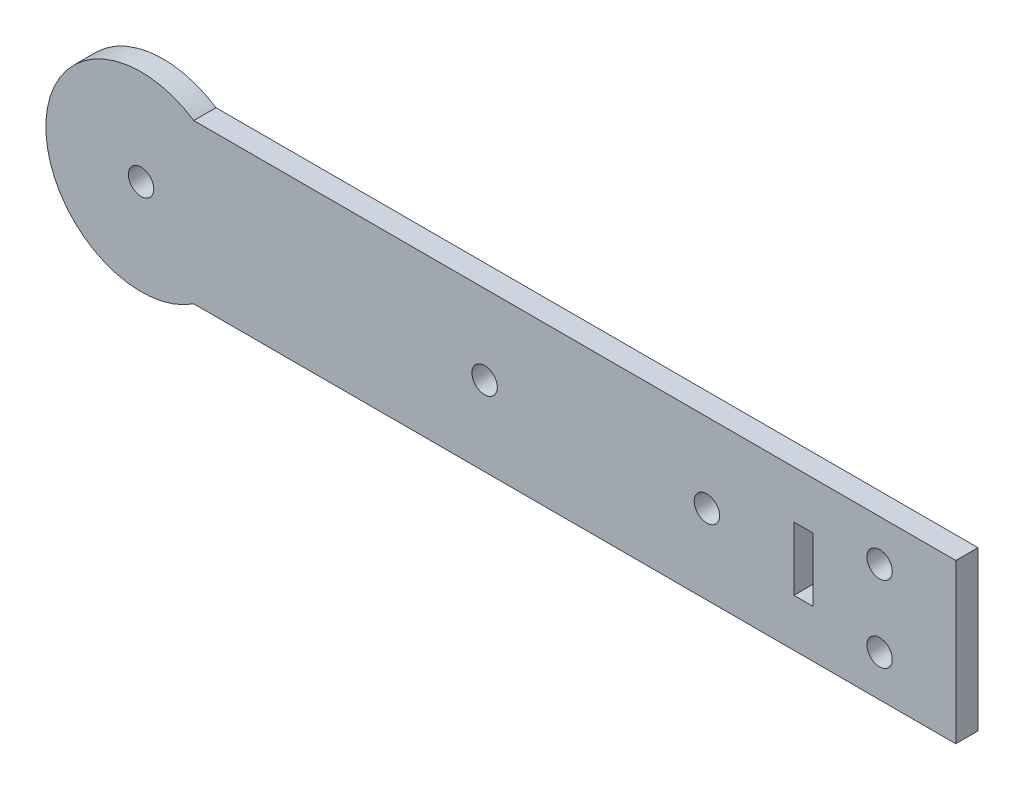
ISO-10303-21;
HEADER;
FILE_DESCRIPTION(('STEP AP214'),'2;1');
FILE_NAME('part.step','',(''),(''),'','','');
FILE_SCHEMA(('AUTOMOTIVE_DESIGN { 1 0 10303 214 1 1 1 1 }'));
ENDSEC;
DATA;
#1=APPLICATION_CONTEXT('core data for automotive mechanical design processes');
#2=APPLICATION_PROTOCOL_DEFINITION('international standard','automotive_design',2000,#1);
#3=PRODUCT_CONTEXT('',#1,'mechanical');
#4=PRODUCT('Part','Part','',(#3));
#5=PRODUCT_RELATED_PRODUCT_CATEGORY('part','',(#4));
#6=PRODUCT_DEFINITION_FORMATION('','',#4);
#7=PRODUCT_DEFINITION_CONTEXT('part definition',#1,'design');
#8=PRODUCT_DEFINITION('design','',#6,#7);
#9=PRODUCT_DEFINITION_SHAPE('','',#8);
#10=(LENGTH_UNIT() NAMED_UNIT(*) SI_UNIT(.MILLI.,.METRE.));
#11=(NAMED_UNIT(*) PLANE_ANGLE_UNIT() SI_UNIT($,.RADIAN.));
#12=(NAMED_UNIT(*) SI_UNIT($,.STERADIAN.) SOLID_ANGLE_UNIT());
#13=UNCERTAINTY_MEASURE_WITH_UNIT(LENGTH_MEASURE(1.E-05),#10,'distance_accuracy_value','');
#14=(GEOMETRIC_REPRESENTATION_CONTEXT(3) GLOBAL_UNCERTAINTY_ASSIGNED_CONTEXT((#13)) GLOBAL_UNIT_ASSIGNED_CONTEXT((#10,
#11,#12)) REPRESENTATION_CONTEXT('',''));
#15=CARTESIAN_POINT('',(0.,0.,0.));
#16=DIRECTION('',(0.,0.,1.));
#17=DIRECTION('',(1.,0.,0.));
#18=AXIS2_PLACEMENT_3D('',#15,#16,#17);
#19=CARTESIAN_POINT('',(-93.389372273481,0.,3.5));
#20=DIRECTION('',(0.,0.,1.));
#21=DIRECTION('',(1.,0.,0.));
#22=AXIS2_PLACEMENT_3D('',#19,#20,#21);
#23=PLANE('',#22);
#24=CARTESIAN_POINT('',(-39.2915619758885,0.,3.5));
#25=DIRECTION('',(0.,0.,1.));
#26=DIRECTION('',(1.,0.,0.));
#27=AXIS2_PLACEMENT_3D('',#24,#25,#26);
#28=CIRCLE('',#27,2.);
#29=CARTESIAN_POINT('',(-37.2915619758885,0.,3.5));
#30=VERTEX_POINT('',#29);
#31=EDGE_CURVE('E279',#30,#30,#28,.T.);
#32=ORIENTED_EDGE('',*,*,#31,.F.);
#33=EDGE_LOOP('',(#32));
#34=FACE_BOUND('',#33,.T.);
#35=DIRECTION('',(-1.,0.,0.));
#36=VECTOR('',#35,1.);
#37=CARTESIAN_POINT('',(9.4021897024075,5.,3.5));
#38=LINE('',#37,#36);
#39=CARTESIAN_POINT('',(12.4021897024075,5.,3.5));
#40=VERTEX_POINT('',#39);
#41=CARTESIAN_POINT('',(9.4021897024075,5.,3.5));
#42=VERTEX_POINT('',#41);
#43=EDGE_CURVE('E117',#40,#42,#38,.T.);
#44=ORIENTED_EDGE('',*,*,#43,.F.);
#45=DIRECTION('',(0.,1.,0.));
#46=VECTOR('',#45,1.);
#47=CARTESIAN_POINT('',(12.4021897024075,5.,3.5));
#48=LINE('',#47,#46);
#49=CARTESIAN_POINT('',(12.4021897024075,-5.,3.5));
#50=VERTEX_POINT('',#49);
#51=EDGE_CURVE('E108',#50,#40,#48,.T.);
#52=ORIENTED_EDGE('',*,*,#51,.F.);
#53=DIRECTION('',(1.,0.,0.));
#54=VECTOR('',#53,1.);
#55=CARTESIAN_POINT('',(9.4021897024075,-5.,3.5));
#56=LINE('',#55,#54);
#57=CARTESIAN_POINT('',(9.4021897024075,-5.,3.5));
#58=VERTEX_POINT('',#57);
#59=EDGE_CURVE('E135',#58,#50,#56,.T.);
#60=ORIENTED_EDGE('',*,*,#59,.F.);
#61=DIRECTION('',(0.,-1.,0.));
#62=VECTOR('',#61,1.);
#63=CARTESIAN_POINT('',(9.4021897024075,5.,3.5));
#64=LINE('',#63,#62);
#65=EDGE_CURVE('E131',#42,#58,#64,.T.);
#66=ORIENTED_EDGE('',*,*,#65,.F.);
#67=EDGE_LOOP('',(#44,#52,#60,#66));
#68=FACE_BOUND('',#67,.T.);
#69=CARTESIAN_POINT('',(-93.389372273481,0.,3.5));
#70=DIRECTION('',(0.,0.,1.));
#71=DIRECTION('',(1.,0.,0.));
#72=AXIS2_PLACEMENT_3D('',#69,#70,#71);
#73=CIRCLE('',#72,2.);
#74=CARTESIAN_POINT('',(-91.389372273481,0.,3.5));
#75=VERTEX_POINT('',#74);
#76=EDGE_CURVE('E159',#75,#75,#73,.T.);
#77=ORIENTED_EDGE('',*,*,#76,.F.);
#78=EDGE_LOOP('',(#77));
#79=FACE_BOUND('',#78,.T.);
#80=CARTESIAN_POINT('',(-93.389372273481,0.,3.5));
#81=DIRECTION('',(0.,0.,1.));
#82=DIRECTION('',(1.,0.,0.));
#83=AXIS2_PLACEMENT_3D('',#80,#81,#82);
#84=CIRCLE('',#83,15.);
#85=CARTESIAN_POINT('',(-85.0978102975925,12.5,3.5));
#86=VERTEX_POINT('',#85);
#87=CARTESIAN_POINT('',(-85.0978102975925,-12.5,3.5));
#88=VERTEX_POINT('',#87);
#89=EDGE_CURVE('E175',#86,#88,#84,.T.);
#90=ORIENTED_EDGE('',*,*,#89,.T.);
#91=DIRECTION('',(1.,0.,0.));
#92=VECTOR('',#91,1.);
#93=CARTESIAN_POINT('',(-85.0978102975925,-12.5,3.5));
#94=LINE('',#93,#92);
#95=CARTESIAN_POINT('',(34.9021897024075,-12.5,3.5));
#96=VERTEX_POINT('',#95);
#97=EDGE_CURVE('E179',#88,#96,#94,.T.);
#98=ORIENTED_EDGE('',*,*,#97,.T.);
#99=DIRECTION('',(0.,1.,0.));
#100=VECTOR('',#99,1.);
#101=CARTESIAN_POINT('',(34.9021897024075,12.5,3.5));
#102=LINE('',#101,#100);
#103=CARTESIAN_POINT('',(34.9021897024075,12.5,3.5));
#104=VERTEX_POINT('',#103);
#105=EDGE_CURVE('E183',#96,#104,#102,.T.);
#106=ORIENTED_EDGE('',*,*,#105,.T.);
#107=DIRECTION('',(-1.,0.,0.));
#108=VECTOR('',#107,1.);
#109=CARTESIAN_POINT('',(-85.0978102975925,12.5,3.5));
#110=LINE('',#109,#108);
#111=EDGE_CURVE('E186',#104,#86,#110,.T.);
#112=ORIENTED_EDGE('',*,*,#111,.T.);
#113=EDGE_LOOP('',(#90,#98,#106,#112));
#114=FACE_BOUND('',#113,.T.);
#115=CARTESIAN_POINT('',(22.9021897024075,6.,3.5));
#116=DIRECTION('',(0.,0.,1.));
#117=DIRECTION('',(1.,0.,0.));
#118=AXIS2_PLACEMENT_3D('',#115,#116,#117);
#119=CIRCLE('',#118,2.);
#120=CARTESIAN_POINT('',(24.9021897024075,6.,3.5));
#121=VERTEX_POINT('',#120);
#122=EDGE_CURVE('E167',#121,#121,#119,.T.);
#123=ORIENTED_EDGE('',*,*,#122,.F.);
#124=EDGE_LOOP('',(#123));
#125=FACE_BOUND('',#124,.T.);
#126=CARTESIAN_POINT('',(22.9021897024075,-6.,3.5));
#127=DIRECTION('',(0.,0.,1.));
#128=DIRECTION('',(-1.,0.,0.));
#129=AXIS2_PLACEMENT_3D('',#126,#127,#128);
#130=CIRCLE('',#129,2.);
#131=CARTESIAN_POINT('',(20.9021897024075,-6.,3.5));
#132=VERTEX_POINT('',#131);
#133=EDGE_CURVE('E143',#132,#132,#130,.T.);
#134=ORIENTED_EDGE('',*,*,#133,.F.);
#135=EDGE_LOOP('',(#134));
#136=FACE_BOUND('',#135,.T.);
#137=CARTESIAN_POINT('',(-4.29156197588848,0.,3.5));
#138=DIRECTION('',(0.,0.,1.));
#139=DIRECTION('',(1.,0.,0.));
#140=AXIS2_PLACEMENT_3D('',#137,#138,#139);
#141=CIRCLE('',#140,2.);
#142=CARTESIAN_POINT('',(-2.29156197588848,0.,3.5));
#143=VERTEX_POINT('',#142);
#144=EDGE_CURVE('E270',#143,#143,#141,.T.);
#145=ORIENTED_EDGE('',*,*,#144,.F.);
#146=EDGE_LOOP('',(#145));
#147=FACE_BOUND('',#146,.T.);
#148=ADVANCED_FACE('F42',(#34,#68,#79,#114,#125,#136,#147),#23,.T.);
#149=CARTESIAN_POINT('',(-93.389372273481,0.,0.));
#150=DIRECTION('',(0.,0.,1.));
#151=DIRECTION('',(1.,0.,0.));
#152=AXIS2_PLACEMENT_3D('',#149,#150,#151);
#153=PLANE('',#152);
#154=CARTESIAN_POINT('',(-93.389372273481,0.,0.));
#155=DIRECTION('',(0.,0.,1.));
#156=DIRECTION('',(1.,0.,0.));
#157=AXIS2_PLACEMENT_3D('',#154,#155,#156);
#158=CIRCLE('',#157,2.);
#159=CARTESIAN_POINT('',(-91.389372273481,0.,0.));
#160=VERTEX_POINT('',#159);
#161=EDGE_CURVE('E126',#160,#160,#158,.T.);
#162=ORIENTED_EDGE('',*,*,#161,.T.);
#163=EDGE_LOOP('',(#162));
#164=FACE_BOUND('',#163,.T.);
#165=CARTESIAN_POINT('',(22.9021897024075,6.,0.));
#166=DIRECTION('',(0.,0.,1.));
#167=DIRECTION('',(1.,0.,0.));
#168=AXIS2_PLACEMENT_3D('',#165,#166,#167);
#169=CIRCLE('',#168,2.);
#170=CARTESIAN_POINT('',(24.9021897024075,6.,0.));
#171=VERTEX_POINT('',#170);
#172=EDGE_CURVE('E163',#171,#171,#169,.T.);
#173=ORIENTED_EDGE('',*,*,#172,.T.);
#174=EDGE_LOOP('',(#173));
#175=FACE_BOUND('',#174,.T.);
#176=CARTESIAN_POINT('',(-93.389372273481,0.,0.));
#177=DIRECTION('',(0.,0.,1.));
#178=DIRECTION('',(1.,0.,0.));
#179=AXIS2_PLACEMENT_3D('',#176,#177,#178);
#180=CIRCLE('',#179,15.);
#181=CARTESIAN_POINT('',(-85.0978102975925,12.5,0.));
#182=VERTEX_POINT('',#181);
#183=CARTESIAN_POINT('',(-85.0978102975925,-12.5,0.));
#184=VERTEX_POINT('',#183);
#185=EDGE_CURVE('E171',#182,#184,#180,.T.);
#186=ORIENTED_EDGE('',*,*,#185,.F.);
#187=DIRECTION('',(-1.,0.,0.));
#188=VECTOR('',#187,1.);
#189=CARTESIAN_POINT('',(-85.0978102975925,12.5,0.));
#190=LINE('',#189,#188);
#191=CARTESIAN_POINT('',(34.9021897024075,12.5,0.));
#192=VERTEX_POINT('',#191);
#193=EDGE_CURVE('E180',#192,#182,#190,.T.);
#194=ORIENTED_EDGE('',*,*,#193,.F.);
#195=DIRECTION('',(0.,1.,0.));
#196=VECTOR('',#195,1.);
#197=CARTESIAN_POINT('',(34.9021897024075,12.5,0.));
#198=LINE('',#197,#196);
#199=CARTESIAN_POINT('',(34.9021897024075,-12.5,0.));
#200=VERTEX_POINT('',#199);
#201=EDGE_CURVE('E196',#200,#192,#198,.T.);
#202=ORIENTED_EDGE('',*,*,#201,.F.);
#203=DIRECTION('',(1.,0.,0.));
#204=VECTOR('',#203,1.);
#205=CARTESIAN_POINT('',(-85.0978102975925,-12.5,0.));
#206=LINE('',#205,#204);
#207=EDGE_CURVE('E193',#184,#200,#206,.T.);
#208=ORIENTED_EDGE('',*,*,#207,.F.);
#209=EDGE_LOOP('',(#186,#194,#202,#208));
#210=FACE_BOUND('',#209,.T.);
#211=DIRECTION('',(0.,1.,0.));
#212=VECTOR('',#211,1.);
#213=CARTESIAN_POINT('',(12.4021897024075,5.,0.));
#214=LINE('',#213,#212);
#215=CARTESIAN_POINT('',(12.4021897024075,-5.,0.));
#216=VERTEX_POINT('',#215);
#217=CARTESIAN_POINT('',(12.4021897024075,5.,0.));
#218=VERTEX_POINT('',#217);
#219=EDGE_CURVE('E66',#216,#218,#214,.T.);
#220=ORIENTED_EDGE('',*,*,#219,.T.);
#221=DIRECTION('',(-1.,0.,0.));
#222=VECTOR('',#221,1.);
#223=CARTESIAN_POINT('',(9.4021897024075,5.,0.));
#224=LINE('',#223,#222);
#225=CARTESIAN_POINT('',(9.4021897024075,5.,0.));
#226=VERTEX_POINT('',#225);
#227=EDGE_CURVE('E124',#218,#226,#224,.T.);
#228=ORIENTED_EDGE('',*,*,#227,.T.);
#229=DIRECTION('',(0.,-1.,0.));
#230=VECTOR('',#229,1.);
#231=CARTESIAN_POINT('',(9.4021897024075,5.,0.));
#232=LINE('',#231,#230);
#233=CARTESIAN_POINT('',(9.4021897024075,-5.,0.));
#234=VERTEX_POINT('',#233);
#235=EDGE_CURVE('E146',#226,#234,#232,.T.);
#236=ORIENTED_EDGE('',*,*,#235,.T.);
#237=DIRECTION('',(1.,0.,0.));
#238=VECTOR('',#237,1.);
#239=CARTESIAN_POINT('',(9.4021897024075,-5.,0.));
#240=LINE('',#239,#238);
#241=EDGE_CURVE('E118',#234,#216,#240,.T.);
#242=ORIENTED_EDGE('',*,*,#241,.T.);
#243=EDGE_LOOP('',(#220,#228,#236,#242));
#244=FACE_BOUND('',#243,.T.);
#245=CARTESIAN_POINT('',(22.9021897024075,-6.,0.));
#246=DIRECTION('',(0.,0.,1.));
#247=DIRECTION('',(-1.,0.,0.));
#248=AXIS2_PLACEMENT_3D('',#245,#246,#247);
#249=CIRCLE('',#248,2.);
#250=CARTESIAN_POINT('',(20.9021897024075,-6.,0.));
#251=VERTEX_POINT('',#250);
#252=EDGE_CURVE('E286',#251,#251,#249,.T.);
#253=ORIENTED_EDGE('',*,*,#252,.T.);
#254=EDGE_LOOP('',(#253));
#255=FACE_BOUND('',#254,.T.);
#256=CARTESIAN_POINT('',(-39.2915619758885,0.,0.));
#257=DIRECTION('',(0.,0.,1.));
#258=DIRECTION('',(1.,0.,0.));
#259=AXIS2_PLACEMENT_3D('',#256,#257,#258);
#260=CIRCLE('',#259,2.);
#261=CARTESIAN_POINT('',(-37.2915619758885,0.,0.));
#262=VERTEX_POINT('',#261);
#263=EDGE_CURVE('E273',#262,#262,#260,.T.);
#264=ORIENTED_EDGE('',*,*,#263,.T.);
#265=EDGE_LOOP('',(#264));
#266=FACE_BOUND('',#265,.T.);
#267=CARTESIAN_POINT('',(-4.29156197588848,0.,0.));
#268=DIRECTION('',(0.,0.,1.));
#269=DIRECTION('',(1.,0.,0.));
#270=AXIS2_PLACEMENT_3D('',#267,#268,#269);
#271=CIRCLE('',#270,2.);
#272=CARTESIAN_POINT('',(-2.29156197588848,0.,0.));
#273=VERTEX_POINT('',#272);
#274=EDGE_CURVE('E274',#273,#273,#271,.T.);
#275=ORIENTED_EDGE('',*,*,#274,.T.);
#276=EDGE_LOOP('',(#275));
#277=FACE_BOUND('',#276,.T.);
#278=ADVANCED_FACE('F219',(#164,#175,#210,#244,#255,#266,#277),#153,.F.);
#279=CARTESIAN_POINT('',(-93.389372273481,0.,3.5));
#280=DIRECTION('',(0.,0.,-1.));
#281=DIRECTION('',(-1.,0.,0.));
#282=AXIS2_PLACEMENT_3D('',#279,#280,#281);
#283=CYLINDRICAL_SURFACE('',#282,15.);
#284=ORIENTED_EDGE('',*,*,#185,.T.);
#285=DIRECTION('',(0.,0.,-1.));
#286=VECTOR('',#285,1.);
#287=CARTESIAN_POINT('',(-85.0978102975925,-12.5,3.5));
#288=LINE('',#287,#286);
#289=EDGE_CURVE('E11',#88,#184,#288,.T.);
#290=ORIENTED_EDGE('',*,*,#289,.F.);
#291=ORIENTED_EDGE('',*,*,#89,.F.);
#292=DIRECTION('',(0.,0.,-1.));
#293=VECTOR('',#292,1.);
#294=CARTESIAN_POINT('',(-85.0978102975925,12.5,3.5));
#295=LINE('',#294,#293);
#296=EDGE_CURVE('E189',#86,#182,#295,.T.);
#297=ORIENTED_EDGE('',*,*,#296,.T.);
#298=EDGE_LOOP('',(#284,#290,#291,#297));
#299=FACE_BOUND('',#298,.T.);
#300=ADVANCED_FACE('F44',(#299),#283,.T.);
#301=CARTESIAN_POINT('',(-85.0978102975925,-12.5,3.5));
#302=DIRECTION('',(0.,1.,0.));
#303=DIRECTION('',(0.,0.,1.));
#304=AXIS2_PLACEMENT_3D('',#301,#302,#303);
#305=PLANE('',#304);
#306=ORIENTED_EDGE('',*,*,#207,.T.);
#307=DIRECTION('',(0.,0.,-1.));
#308=VECTOR('',#307,1.);
#309=CARTESIAN_POINT('',(34.9021897024075,-12.5,3.5));
#310=LINE('',#309,#308);
#311=EDGE_CURVE('E51',#96,#200,#310,.T.);
#312=ORIENTED_EDGE('',*,*,#311,.F.);
#313=ORIENTED_EDGE('',*,*,#97,.F.);
#314=ORIENTED_EDGE('',*,*,#289,.T.);
#315=EDGE_LOOP('',(#306,#312,#313,#314));
#316=FACE_BOUND('',#315,.T.);
#317=ADVANCED_FACE('F230',(#316),#305,.F.);
#318=CARTESIAN_POINT('',(34.9021897024075,12.5,3.5));
#319=DIRECTION('',(-1.,0.,0.));
#320=DIRECTION('',(0.,0.,1.));
#321=AXIS2_PLACEMENT_3D('',#318,#319,#320);
#322=PLANE('',#321);
#323=ORIENTED_EDGE('',*,*,#201,.T.);
#324=DIRECTION('',(0.,0.,-1.));
#325=VECTOR('',#324,1.);
#326=CARTESIAN_POINT('',(34.9021897024075,12.5,3.5));
#327=LINE('',#326,#325);
#328=EDGE_CURVE('E204',#104,#192,#327,.T.);
#329=ORIENTED_EDGE('',*,*,#328,.F.);
#330=ORIENTED_EDGE('',*,*,#105,.F.);
#331=ORIENTED_EDGE('',*,*,#311,.T.);
#332=EDGE_LOOP('',(#323,#329,#330,#331));
#333=FACE_BOUND('',#332,.T.);
#334=ADVANCED_FACE('F213',(#333),#322,.F.);
#335=CARTESIAN_POINT('',(-85.0978102975925,12.5,3.5));
#336=DIRECTION('',(0.,-1.,0.));
#337=DIRECTION('',(0.,0.,-1.));
#338=AXIS2_PLACEMENT_3D('',#335,#336,#337);
#339=PLANE('',#338);
#340=ORIENTED_EDGE('',*,*,#193,.T.);
#341=ORIENTED_EDGE('',*,*,#296,.F.);
#342=ORIENTED_EDGE('',*,*,#111,.F.);
#343=ORIENTED_EDGE('',*,*,#328,.T.);
#344=EDGE_LOOP('',(#340,#341,#342,#343));
#345=FACE_BOUND('',#344,.T.);
#346=ADVANCED_FACE('F223',(#345),#339,.F.);
#347=CARTESIAN_POINT('',(22.9021897024075,6.,3.5));
#348=DIRECTION('',(0.,0.,-1.));
#349=DIRECTION('',(-1.,0.,0.));
#350=AXIS2_PLACEMENT_3D('',#347,#348,#349);
#351=CYLINDRICAL_SURFACE('',#350,2.);
#352=ORIENTED_EDGE('',*,*,#122,.T.);
#353=EDGE_LOOP('',(#352));
#354=FACE_BOUND('',#353,.T.);
#355=ORIENTED_EDGE('',*,*,#172,.F.);
#356=EDGE_LOOP('',(#355));
#357=FACE_BOUND('',#356,.T.);
#358=ADVANCED_FACE('F247',(#354,#357),#351,.F.);
#359=CARTESIAN_POINT('',(-93.389372273481,0.,3.5));
#360=DIRECTION('',(0.,0.,-1.));
#361=DIRECTION('',(-1.,0.,0.));
#362=AXIS2_PLACEMENT_3D('',#359,#360,#361);
#363=CYLINDRICAL_SURFACE('',#362,2.);
#364=ORIENTED_EDGE('',*,*,#76,.T.);
#365=EDGE_LOOP('',(#364));
#366=FACE_BOUND('',#365,.T.);
#367=ORIENTED_EDGE('',*,*,#161,.F.);
#368=EDGE_LOOP('',(#367));
#369=FACE_BOUND('',#368,.T.);
#370=ADVANCED_FACE('F254',(#366,#369),#363,.F.);
#371=CARTESIAN_POINT('',(12.4021897024075,5.,3.5));
#372=DIRECTION('',(-1.,0.,0.));
#373=DIRECTION('',(0.,0.,1.));
#374=AXIS2_PLACEMENT_3D('',#371,#372,#373);
#375=PLANE('',#374);
#376=ORIENTED_EDGE('',*,*,#219,.F.);
#377=DIRECTION('',(0.,0.,-1.));
#378=VECTOR('',#377,1.);
#379=CARTESIAN_POINT('',(12.4021897024075,-5.,3.5));
#380=LINE('',#379,#378);
#381=EDGE_CURVE('E112',#50,#216,#380,.T.);
#382=ORIENTED_EDGE('',*,*,#381,.F.);
#383=ORIENTED_EDGE('',*,*,#51,.T.);
#384=DIRECTION('',(0.,0.,-1.));
#385=VECTOR('',#384,1.);
#386=CARTESIAN_POINT('',(12.4021897024075,5.,3.5));
#387=LINE('',#386,#385);
#388=EDGE_CURVE('E111',#40,#218,#387,.T.);
#389=ORIENTED_EDGE('',*,*,#388,.T.);
#390=EDGE_LOOP('',(#376,#382,#383,#389));
#391=FACE_BOUND('',#390,.T.);
#392=ADVANCED_FACE('F110',(#391),#375,.T.);
#393=CARTESIAN_POINT('',(9.4021897024075,5.,3.5));
#394=DIRECTION('',(0.,-1.,0.));
#395=DIRECTION('',(0.,0.,-1.));
#396=AXIS2_PLACEMENT_3D('',#393,#394,#395);
#397=PLANE('',#396);
#398=ORIENTED_EDGE('',*,*,#227,.F.);
#399=ORIENTED_EDGE('',*,*,#388,.F.);
#400=ORIENTED_EDGE('',*,*,#43,.T.);
#401=DIRECTION('',(0.,0.,-1.));
#402=VECTOR('',#401,1.);
#403=CARTESIAN_POINT('',(9.4021897024075,5.,3.5));
#404=LINE('',#403,#402);
#405=EDGE_CURVE('E127',#42,#226,#404,.T.);
#406=ORIENTED_EDGE('',*,*,#405,.T.);
#407=EDGE_LOOP('',(#398,#399,#400,#406));
#408=FACE_BOUND('',#407,.T.);
#409=ADVANCED_FACE('F121',(#408),#397,.T.);
#410=CARTESIAN_POINT('',(9.4021897024075,5.,3.5));
#411=DIRECTION('',(1.,0.,0.));
#412=DIRECTION('',(0.,0.,-1.));
#413=AXIS2_PLACEMENT_3D('',#410,#411,#412);
#414=PLANE('',#413);
#415=ORIENTED_EDGE('',*,*,#235,.F.);
#416=ORIENTED_EDGE('',*,*,#405,.F.);
#417=ORIENTED_EDGE('',*,*,#65,.T.);
#418=DIRECTION('',(0.,0.,-1.));
#419=VECTOR('',#418,1.);
#420=CARTESIAN_POINT('',(9.4021897024075,-5.,3.5));
#421=LINE('',#420,#419);
#422=EDGE_CURVE('E58',#58,#234,#421,.T.);
#423=ORIENTED_EDGE('',*,*,#422,.T.);
#424=EDGE_LOOP('',(#415,#416,#417,#423));
#425=FACE_BOUND('',#424,.T.);
#426=ADVANCED_FACE('F308',(#425),#414,.T.);
#427=CARTESIAN_POINT('',(9.4021897024075,-5.,3.5));
#428=DIRECTION('',(0.,1.,0.));
#429=DIRECTION('',(0.,0.,1.));
#430=AXIS2_PLACEMENT_3D('',#427,#428,#429);
#431=PLANE('',#430);
#432=ORIENTED_EDGE('',*,*,#241,.F.);
#433=ORIENTED_EDGE('',*,*,#422,.F.);
#434=ORIENTED_EDGE('',*,*,#59,.T.);
#435=ORIENTED_EDGE('',*,*,#381,.T.);
#436=EDGE_LOOP('',(#432,#433,#434,#435));
#437=FACE_BOUND('',#436,.T.);
#438=ADVANCED_FACE('F298',(#437),#431,.T.);
#439=CARTESIAN_POINT('',(22.9021897024075,-6.,3.5));
#440=DIRECTION('',(0.,0.,-1.));
#441=DIRECTION('',(-1.,0.,0.));
#442=AXIS2_PLACEMENT_3D('',#439,#440,#441);
#443=CYLINDRICAL_SURFACE('',#442,2.);
#444=ORIENTED_EDGE('',*,*,#133,.T.);
#445=EDGE_LOOP('',(#444));
#446=FACE_BOUND('',#445,.T.);
#447=ORIENTED_EDGE('',*,*,#252,.F.);
#448=EDGE_LOOP('',(#447));
#449=FACE_BOUND('',#448,.T.);
#450=ADVANCED_FACE('F295',(#446,#449),#443,.F.);
#451=CARTESIAN_POINT('',(-39.2915619758885,0.,3.5));
#452=DIRECTION('',(0.,0.,-1.));
#453=DIRECTION('',(-1.,0.,0.));
#454=AXIS2_PLACEMENT_3D('',#451,#452,#453);
#455=CYLINDRICAL_SURFACE('',#454,2.);
#456=ORIENTED_EDGE('',*,*,#31,.T.);
#457=EDGE_LOOP('',(#456));
#458=FACE_BOUND('',#457,.T.);
#459=ORIENTED_EDGE('',*,*,#263,.F.);
#460=EDGE_LOOP('',(#459));
#461=FACE_BOUND('',#460,.T.);
#462=ADVANCED_FACE('F297',(#458,#461),#455,.F.);
#463=CARTESIAN_POINT('',(-4.29156197588848,0.,3.5));
#464=DIRECTION('',(0.,0.,-1.));
#465=DIRECTION('',(-1.,0.,0.));
#466=AXIS2_PLACEMENT_3D('',#463,#464,#465);
#467=CYLINDRICAL_SURFACE('',#466,2.);
#468=ORIENTED_EDGE('',*,*,#144,.T.);
#469=EDGE_LOOP('',(#468));
#470=FACE_BOUND('',#469,.T.);
#471=ORIENTED_EDGE('',*,*,#274,.F.);
#472=EDGE_LOOP('',(#471));
#473=FACE_BOUND('',#472,.T.);
#474=ADVANCED_FACE('F305',(#470,#473),#467,.F.);
#475=CLOSED_SHELL('',(#148,#278,#300,#317,#334,#346,#358,#370,#392,#409,#426,#438,#450,#462,#474));
#476=MANIFOLD_SOLID_BREP('B2',#475);
#477=ADVANCED_BREP_SHAPE_REPRESENTATION('',(#18,#476),#14);
#478=SHAPE_DEFINITION_REPRESENTATION(#9,#477);
ENDSEC;
END-ISO-10303-21;
